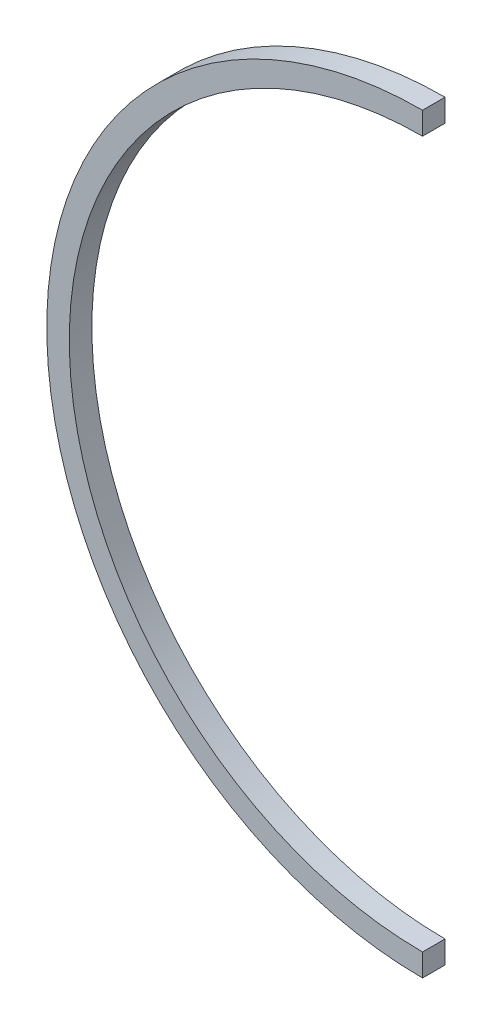
ISO-10303-21;
HEADER;
FILE_DESCRIPTION(('STEP AP214'),'2;1');
FILE_NAME('part.step','',(''),(''),'','','');
FILE_SCHEMA(('AUTOMOTIVE_DESIGN { 1 0 10303 214 1 1 1 1 }'));
ENDSEC;
DATA;
#1=APPLICATION_CONTEXT('core data for automotive mechanical design processes');
#2=APPLICATION_PROTOCOL_DEFINITION('international standard','automotive_design',2000,#1);
#3=PRODUCT_CONTEXT('',#1,'mechanical');
#4=PRODUCT('Part','Part','',(#3));
#5=PRODUCT_RELATED_PRODUCT_CATEGORY('part','',(#4));
#6=PRODUCT_DEFINITION_FORMATION('','',#4);
#7=PRODUCT_DEFINITION_CONTEXT('part definition',#1,'design');
#8=PRODUCT_DEFINITION('design','',#6,#7);
#9=PRODUCT_DEFINITION_SHAPE('','',#8);
#10=(LENGTH_UNIT() NAMED_UNIT(*) SI_UNIT(.MILLI.,.METRE.));
#11=(NAMED_UNIT(*) PLANE_ANGLE_UNIT() SI_UNIT($,.RADIAN.));
#12=(NAMED_UNIT(*) SI_UNIT($,.STERADIAN.) SOLID_ANGLE_UNIT());
#13=UNCERTAINTY_MEASURE_WITH_UNIT(LENGTH_MEASURE(1.E-05),#10,'distance_accuracy_value','');
#14=(GEOMETRIC_REPRESENTATION_CONTEXT(3) GLOBAL_UNCERTAINTY_ASSIGNED_CONTEXT((#13)) GLOBAL_UNIT_ASSIGNED_CONTEXT((#10,
#11,#12)) REPRESENTATION_CONTEXT('',''));
#15=CARTESIAN_POINT('',(0.,0.,0.));
#16=DIRECTION('',(0.,0.,1.));
#17=DIRECTION('',(1.,0.,0.));
#18=AXIS2_PLACEMENT_3D('',#15,#16,#17);
#19=CARTESIAN_POINT('',(0.,0.,3.));
#20=DIRECTION('',(0.,0.,1.));
#21=DIRECTION('',(1.,0.,0.));
#22=AXIS2_PLACEMENT_3D('',#19,#20,#21);
#23=PLANE('',#22);
#24=DIRECTION('',(0.,1.,0.));
#25=VECTOR('',#24,1.);
#26=CARTESIAN_POINT('',(-300.,0.,3.));
#27=LINE('',#26,#25);
#28=CARTESIAN_POINT('',(-300.,-50.,3.));
#29=VERTEX_POINT('',#28);
#30=CARTESIAN_POINT('',(-300.,-47.,3.));
#31=VERTEX_POINT('',#30);
#32=EDGE_CURVE('E78',#29,#31,#27,.T.);
#33=ORIENTED_EDGE('',*,*,#32,.T.);
#34=CARTESIAN_POINT('',(-300.,0.,3.));
#35=DIRECTION('',(0.,0.,1.));
#36=DIRECTION('',(1.,0.,0.));
#37=AXIS2_PLACEMENT_3D('',#34,#35,#36);
#38=CIRCLE('',#37,47.);
#39=CARTESIAN_POINT('',(-300.,47.,3.));
#40=VERTEX_POINT('',#39);
#41=EDGE_CURVE('E83',#31,#40,#38,.F.);
#42=ORIENTED_EDGE('',*,*,#41,.T.);
#43=DIRECTION('',(0.,1.,0.));
#44=VECTOR('',#43,1.);
#45=CARTESIAN_POINT('',(-300.,0.,3.));
#46=LINE('',#45,#44);
#47=CARTESIAN_POINT('',(-300.,50.,3.));
#48=VERTEX_POINT('',#47);
#49=EDGE_CURVE('E82',#40,#48,#46,.T.);
#50=ORIENTED_EDGE('',*,*,#49,.T.);
#51=CARTESIAN_POINT('',(-300.,0.,3.));
#52=DIRECTION('',(0.,0.,1.));
#53=DIRECTION('',(1.,0.,0.));
#54=AXIS2_PLACEMENT_3D('',#51,#52,#53);
#55=CIRCLE('',#54,50.);
#56=EDGE_CURVE('E73',#48,#29,#55,.T.);
#57=ORIENTED_EDGE('',*,*,#56,.T.);
#58=EDGE_LOOP('',(#33,#42,#50,#57));
#59=FACE_BOUND('',#58,.T.);
#60=ADVANCED_FACE('F32',(#59),#23,.T.);
#61=CARTESIAN_POINT('',(-300.,0.,0.));
#62=DIRECTION('',(-1.,0.,0.));
#63=DIRECTION('',(0.,0.,1.));
#64=AXIS2_PLACEMENT_3D('',#61,#62,#63);
#65=PLANE('',#64);
#66=ORIENTED_EDGE('',*,*,#49,.F.);
#67=DIRECTION('',(0.,0.,1.));
#68=VECTOR('',#67,1.);
#69=CARTESIAN_POINT('',(-300.,47.,3.));
#70=LINE('',#69,#68);
#71=CARTESIAN_POINT('',(-300.,47.,0.));
#72=VERTEX_POINT('',#71);
#73=EDGE_CURVE('E90',#72,#40,#70,.T.);
#74=ORIENTED_EDGE('',*,*,#73,.F.);
#75=DIRECTION('',(0.,-1.,0.));
#76=VECTOR('',#75,1.);
#77=CARTESIAN_POINT('',(-300.,0.,0.));
#78=LINE('',#77,#76);
#79=CARTESIAN_POINT('',(-300.,50.,0.));
#80=VERTEX_POINT('',#79);
#81=EDGE_CURVE('E76',#80,#72,#78,.T.);
#82=ORIENTED_EDGE('',*,*,#81,.F.);
#83=DIRECTION('',(0.,0.,-1.));
#84=VECTOR('',#83,1.);
#85=CARTESIAN_POINT('',(-300.,50.,60.));
#86=LINE('',#85,#84);
#87=EDGE_CURVE('E92',#48,#80,#86,.T.);
#88=ORIENTED_EDGE('',*,*,#87,.F.);
#89=EDGE_LOOP('',(#66,#74,#82,#88));
#90=FACE_BOUND('',#89,.T.);
#91=ADVANCED_FACE('F105',(#90),#65,.F.);
#92=ORIENTED_EDGE('',*,*,#32,.F.);
#93=DIRECTION('',(0.,0.,-1.));
#94=VECTOR('',#93,1.);
#95=CARTESIAN_POINT('',(-300.,-50.,60.));
#96=LINE('',#95,#94);
#97=CARTESIAN_POINT('',(-300.,-50.,0.));
#98=VERTEX_POINT('',#97);
#99=EDGE_CURVE('E40',#29,#98,#96,.T.);
#100=ORIENTED_EDGE('',*,*,#99,.T.);
#101=CARTESIAN_POINT('',(-300.,-47.,0.));
#102=VERTEX_POINT('',#101);
#103=EDGE_CURVE('E95',#102,#98,#78,.T.);
#104=ORIENTED_EDGE('',*,*,#103,.F.);
#105=DIRECTION('',(0.,0.,1.));
#106=VECTOR('',#105,1.);
#107=CARTESIAN_POINT('',(-300.,-47.,3.));
#108=LINE('',#107,#106);
#109=EDGE_CURVE('E11',#102,#31,#108,.T.);
#110=ORIENTED_EDGE('',*,*,#109,.T.);
#111=EDGE_LOOP('',(#92,#100,#104,#110));
#112=FACE_BOUND('',#111,.T.);
#113=ADVANCED_FACE('F79',(#112),#65,.F.);
#114=CARTESIAN_POINT('',(-300.,0.,3.));
#115=DIRECTION('',(0.,0.,1.));
#116=DIRECTION('',(1.,0.,0.));
#117=AXIS2_PLACEMENT_3D('',#114,#115,#116);
#118=CYLINDRICAL_SURFACE('',#117,47.);
#119=ORIENTED_EDGE('',*,*,#41,.F.);
#120=ORIENTED_EDGE('',*,*,#109,.F.);
#121=CARTESIAN_POINT('',(-300.,0.,0.));
#122=DIRECTION('',(0.,0.,-1.));
#123=DIRECTION('',(-1.,0.,0.));
#124=AXIS2_PLACEMENT_3D('',#121,#122,#123);
#125=CIRCLE('',#124,47.);
#126=EDGE_CURVE('E93',#102,#72,#125,.T.);
#127=ORIENTED_EDGE('',*,*,#126,.T.);
#128=ORIENTED_EDGE('',*,*,#73,.T.);
#129=EDGE_LOOP('',(#119,#120,#127,#128));
#130=FACE_BOUND('',#129,.T.);
#131=ADVANCED_FACE('F34',(#130),#118,.F.);
#132=CARTESIAN_POINT('',(-300.,0.,60.));
#133=DIRECTION('',(0.,0.,-1.));
#134=DIRECTION('',(-1.,0.,0.));
#135=AXIS2_PLACEMENT_3D('',#132,#133,#134);
#136=CYLINDRICAL_SURFACE('',#135,50.);
#137=ORIENTED_EDGE('',*,*,#56,.F.);
#138=ORIENTED_EDGE('',*,*,#87,.T.);
#139=CARTESIAN_POINT('',(-300.,0.,0.));
#140=DIRECTION('',(0.,0.,1.));
#141=DIRECTION('',(1.,0.,0.));
#142=AXIS2_PLACEMENT_3D('',#139,#140,#141);
#143=CIRCLE('',#142,50.);
#144=EDGE_CURVE('E75',#80,#98,#143,.T.);
#145=ORIENTED_EDGE('',*,*,#144,.T.);
#146=ORIENTED_EDGE('',*,*,#99,.F.);
#147=EDGE_LOOP('',(#137,#138,#145,#146));
#148=FACE_BOUND('',#147,.T.);
#149=ADVANCED_FACE('F71',(#148),#136,.T.);
#150=CARTESIAN_POINT('',(-300.,0.,0.));
#151=DIRECTION('',(0.,0.,1.));
#152=DIRECTION('',(1.,0.,0.));
#153=AXIS2_PLACEMENT_3D('',#150,#151,#152);
#154=PLANE('',#153);
#155=ORIENTED_EDGE('',*,*,#144,.F.);
#156=ORIENTED_EDGE('',*,*,#81,.T.);
#157=ORIENTED_EDGE('',*,*,#126,.F.);
#158=ORIENTED_EDGE('',*,*,#103,.T.);
#159=EDGE_LOOP('',(#155,#156,#157,#158));
#160=FACE_BOUND('',#159,.T.);
#161=ADVANCED_FACE('F103',(#160),#154,.F.);
#162=CLOSED_SHELL('',(#60,#91,#113,#131,#149,#161));
#163=MANIFOLD_SOLID_BREP('B2',#162);
#164=ADVANCED_BREP_SHAPE_REPRESENTATION('',(#18,#163),#14);
#165=SHAPE_DEFINITION_REPRESENTATION(#9,#164);
ENDSEC;
END-ISO-10303-21;
